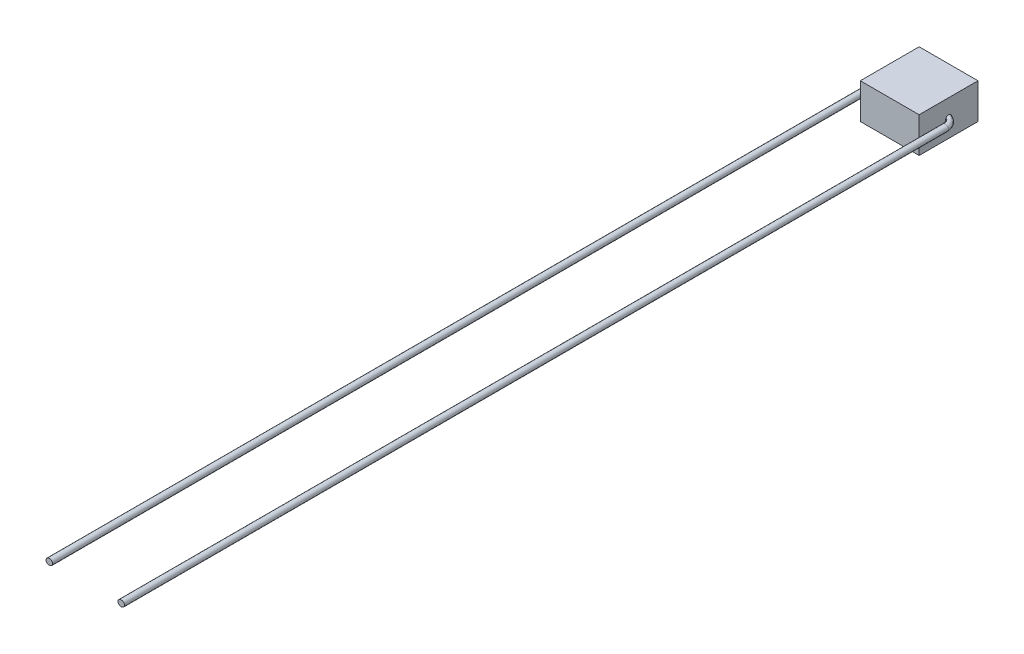
ISO-10303-21;
HEADER;
FILE_DESCRIPTION(('STEP AP214'),'2;1');
FILE_NAME('part.step','',(''),(''),'','','');
FILE_SCHEMA(('AUTOMOTIVE_DESIGN { 1 0 10303 214 1 1 1 1 }'));
ENDSEC;
DATA;
#1=APPLICATION_CONTEXT('core data for automotive mechanical design processes');
#2=APPLICATION_PROTOCOL_DEFINITION('international standard','automotive_design',2000,#1);
#3=PRODUCT_CONTEXT('',#1,'mechanical');
#4=PRODUCT('Part','Part','',(#3));
#5=PRODUCT_RELATED_PRODUCT_CATEGORY('part','',(#4));
#6=PRODUCT_DEFINITION_FORMATION('','',#4);
#7=PRODUCT_DEFINITION_CONTEXT('part definition',#1,'design');
#8=PRODUCT_DEFINITION('design','',#6,#7);
#9=PRODUCT_DEFINITION_SHAPE('','',#8);
#10=(LENGTH_UNIT() NAMED_UNIT(*) SI_UNIT(.MILLI.,.METRE.));
#11=(NAMED_UNIT(*) PLANE_ANGLE_UNIT() SI_UNIT($,.RADIAN.));
#12=(NAMED_UNIT(*) SI_UNIT($,.STERADIAN.) SOLID_ANGLE_UNIT());
#13=UNCERTAINTY_MEASURE_WITH_UNIT(LENGTH_MEASURE(1.E-05),#10,'distance_accuracy_value','');
#14=(GEOMETRIC_REPRESENTATION_CONTEXT(3) GLOBAL_UNCERTAINTY_ASSIGNED_CONTEXT((#13)) GLOBAL_UNIT_ASSIGNED_CONTEXT((#10,
#11,#12)) REPRESENTATION_CONTEXT('',''));
#15=CARTESIAN_POINT('',(0.,0.,0.));
#16=DIRECTION('',(0.,0.,1.));
#17=DIRECTION('',(1.,0.,0.));
#18=AXIS2_PLACEMENT_3D('',#15,#16,#17);
#19=CARTESIAN_POINT('',(-2.5,3.,-2.5));
#20=DIRECTION('',(1.,0.,0.));
#21=DIRECTION('',(0.,0.,-1.));
#22=AXIS2_PLACEMENT_3D('',#19,#20,#21);
#23=PLANE('',#22);
#24=DIRECTION('',(0.,0.,1.));
#25=VECTOR('',#24,1.);
#26=CARTESIAN_POINT('',(-2.5,0.,-2.5));
#27=LINE('',#26,#25);
#28=CARTESIAN_POINT('',(-2.5,0.,-2.5));
#29=VERTEX_POINT('',#28);
#30=CARTESIAN_POINT('',(-2.5,0.,2.5));
#31=VERTEX_POINT('',#30);
#32=EDGE_CURVE('E114',#29,#31,#27,.T.);
#33=ORIENTED_EDGE('',*,*,#32,.T.);
#34=DIRECTION('',(0.,-1.,0.));
#35=VECTOR('',#34,1.);
#36=CARTESIAN_POINT('',(-2.5,3.,2.5));
#37=LINE('',#36,#35);
#38=CARTESIAN_POINT('',(-2.5,3.,2.5));
#39=VERTEX_POINT('',#38);
#40=EDGE_CURVE('E50',#39,#31,#37,.T.);
#41=ORIENTED_EDGE('',*,*,#40,.F.);
#42=DIRECTION('',(0.,0.,1.));
#43=VECTOR('',#42,1.);
#44=CARTESIAN_POINT('',(-2.5,3.,-2.5));
#45=LINE('',#44,#43);
#46=CARTESIAN_POINT('',(-2.5,3.,-2.5));
#47=VERTEX_POINT('',#46);
#48=EDGE_CURVE('E94',#47,#39,#45,.T.);
#49=ORIENTED_EDGE('',*,*,#48,.F.);
#50=DIRECTION('',(0.,-1.,0.));
#51=VECTOR('',#50,1.);
#52=CARTESIAN_POINT('',(-2.5,3.,-2.5));
#53=LINE('',#52,#51);
#54=EDGE_CURVE('E110',#47,#29,#53,.T.);
#55=ORIENTED_EDGE('',*,*,#54,.T.);
#56=EDGE_LOOP('',(#33,#41,#49,#55));
#57=FACE_BOUND('',#56,.T.);
#58=CARTESIAN_POINT('',(-2.5,1.5,0.));
#59=DIRECTION('',(1.,0.,0.));
#60=DIRECTION('',(0.,0.,-1.));
#61=AXIS2_PLACEMENT_3D('',#58,#59,#60);
#62=CIRCLE('',#61,0.25);
#63=CARTESIAN_POINT('',(-2.5,1.5,-0.25));
#64=VERTEX_POINT('',#63);
#65=EDGE_CURVE('E11',#64,#64,#62,.F.);
#66=ORIENTED_EDGE('',*,*,#65,.F.);
#67=EDGE_LOOP('',(#66));
#68=FACE_BOUND('',#67,.T.);
#69=ADVANCED_FACE('F41',(#57,#68),#23,.F.);
#70=CARTESIAN_POINT('',(-2.5,3.,2.5));
#71=DIRECTION('',(0.,0.,-1.));
#72=DIRECTION('',(-1.,0.,0.));
#73=AXIS2_PLACEMENT_3D('',#70,#71,#72);
#74=PLANE('',#73);
#75=DIRECTION('',(1.,0.,0.));
#76=VECTOR('',#75,1.);
#77=CARTESIAN_POINT('',(-2.5,0.,2.5));
#78=LINE('',#77,#76);
#79=CARTESIAN_POINT('',(2.5,0.,2.5));
#80=VERTEX_POINT('',#79);
#81=EDGE_CURVE('E100',#31,#80,#78,.T.);
#82=ORIENTED_EDGE('',*,*,#81,.T.);
#83=DIRECTION('',(0.,-1.,0.));
#84=VECTOR('',#83,1.);
#85=CARTESIAN_POINT('',(2.5,3.,2.5));
#86=LINE('',#85,#84);
#87=CARTESIAN_POINT('',(2.5,3.,2.5));
#88=VERTEX_POINT('',#87);
#89=EDGE_CURVE('E98',#88,#80,#86,.T.);
#90=ORIENTED_EDGE('',*,*,#89,.F.);
#91=DIRECTION('',(1.,0.,0.));
#92=VECTOR('',#91,1.);
#93=CARTESIAN_POINT('',(-2.5,3.,2.5));
#94=LINE('',#93,#92);
#95=EDGE_CURVE('E89',#39,#88,#94,.T.);
#96=ORIENTED_EDGE('',*,*,#95,.F.);
#97=ORIENTED_EDGE('',*,*,#40,.T.);
#98=EDGE_LOOP('',(#82,#90,#96,#97));
#99=FACE_BOUND('',#98,.T.);
#100=ADVANCED_FACE('F99',(#99),#74,.F.);
#101=CARTESIAN_POINT('',(2.5,3.,-2.5));
#102=DIRECTION('',(-1.,0.,0.));
#103=DIRECTION('',(0.,0.,1.));
#104=AXIS2_PLACEMENT_3D('',#101,#102,#103);
#105=PLANE('',#104);
#106=CARTESIAN_POINT('',(2.5,1.5,0.));
#107=DIRECTION('',(1.,0.,0.));
#108=DIRECTION('',(0.,0.,-1.));
#109=AXIS2_PLACEMENT_3D('',#106,#107,#108);
#110=CIRCLE('',#109,0.25);
#111=CARTESIAN_POINT('',(2.5,1.5,-0.25));
#112=VERTEX_POINT('',#111);
#113=EDGE_CURVE('E118',#112,#112,#110,.T.);
#114=ORIENTED_EDGE('',*,*,#113,.F.);
#115=EDGE_LOOP('',(#114));
#116=FACE_BOUND('',#115,.T.);
#117=DIRECTION('',(0.,0.,-1.));
#118=VECTOR('',#117,1.);
#119=CARTESIAN_POINT('',(2.5,0.,-2.5));
#120=LINE('',#119,#118);
#121=CARTESIAN_POINT('',(2.5,0.,-2.5));
#122=VERTEX_POINT('',#121);
#123=EDGE_CURVE('E75',#80,#122,#120,.T.);
#124=ORIENTED_EDGE('',*,*,#123,.T.);
#125=DIRECTION('',(0.,-1.,0.));
#126=VECTOR('',#125,1.);
#127=CARTESIAN_POINT('',(2.5,3.,-2.5));
#128=LINE('',#127,#126);
#129=CARTESIAN_POINT('',(2.5,3.,-2.5));
#130=VERTEX_POINT('',#129);
#131=EDGE_CURVE('E102',#130,#122,#128,.T.);
#132=ORIENTED_EDGE('',*,*,#131,.F.);
#133=DIRECTION('',(0.,0.,-1.));
#134=VECTOR('',#133,1.);
#135=CARTESIAN_POINT('',(2.5,3.,-2.5));
#136=LINE('',#135,#134);
#137=EDGE_CURVE('E92',#88,#130,#136,.T.);
#138=ORIENTED_EDGE('',*,*,#137,.F.);
#139=ORIENTED_EDGE('',*,*,#89,.T.);
#140=EDGE_LOOP('',(#124,#132,#138,#139));
#141=FACE_BOUND('',#140,.T.);
#142=ADVANCED_FACE('F104',(#116,#141),#105,.F.);
#143=CARTESIAN_POINT('',(-2.5,3.,-2.5));
#144=DIRECTION('',(0.,0.,1.));
#145=DIRECTION('',(1.,0.,0.));
#146=AXIS2_PLACEMENT_3D('',#143,#144,#145);
#147=PLANE('',#146);
#148=DIRECTION('',(-1.,0.,0.));
#149=VECTOR('',#148,1.);
#150=CARTESIAN_POINT('',(-2.5,0.,-2.5));
#151=LINE('',#150,#149);
#152=EDGE_CURVE('E81',#122,#29,#151,.T.);
#153=ORIENTED_EDGE('',*,*,#152,.T.);
#154=ORIENTED_EDGE('',*,*,#54,.F.);
#155=DIRECTION('',(-1.,0.,0.));
#156=VECTOR('',#155,1.);
#157=CARTESIAN_POINT('',(-2.5,3.,-2.5));
#158=LINE('',#157,#156);
#159=EDGE_CURVE('E58',#130,#47,#158,.T.);
#160=ORIENTED_EDGE('',*,*,#159,.F.);
#161=ORIENTED_EDGE('',*,*,#131,.T.);
#162=EDGE_LOOP('',(#153,#154,#160,#161));
#163=FACE_BOUND('',#162,.T.);
#164=ADVANCED_FACE('F144',(#163),#147,.F.);
#165=CARTESIAN_POINT('',(0.,3.,0.));
#166=DIRECTION('',(0.,1.,0.));
#167=DIRECTION('',(0.,0.,1.));
#168=AXIS2_PLACEMENT_3D('',#165,#166,#167);
#169=PLANE('',#168);
#170=ORIENTED_EDGE('',*,*,#48,.T.);
#171=ORIENTED_EDGE('',*,*,#95,.T.);
#172=ORIENTED_EDGE('',*,*,#137,.T.);
#173=ORIENTED_EDGE('',*,*,#159,.T.);
#174=EDGE_LOOP('',(#170,#171,#172,#173));
#175=FACE_BOUND('',#174,.T.);
#176=ADVANCED_FACE('F90',(#175),#169,.T.);
#177=CARTESIAN_POINT('',(0.,0.,0.));
#178=DIRECTION('',(0.,1.,0.));
#179=DIRECTION('',(0.,0.,1.));
#180=AXIS2_PLACEMENT_3D('',#177,#178,#179);
#181=PLANE('',#180);
#182=ORIENTED_EDGE('',*,*,#32,.F.);
#183=ORIENTED_EDGE('',*,*,#152,.F.);
#184=ORIENTED_EDGE('',*,*,#123,.F.);
#185=ORIENTED_EDGE('',*,*,#81,.F.);
#186=EDGE_LOOP('',(#182,#183,#184,#185));
#187=FACE_BOUND('',#186,.T.);
#188=ADVANCED_FACE('F133',(#187),#181,.F.);
#189=CARTESIAN_POINT('',(2.5,1.5,-0.25));
#190=CARTESIAN_POINT('',(2.57893203698894,1.5,-0.21520301726241));
#191=CARTESIAN_POINT('',(2.73295056280089,1.5,-0.147304351671167));
#192=CARTESIAN_POINT('',(2.9533834381563,1.5,0.0116007905448319));
#193=CARTESIAN_POINT('',(3.12623759924124,1.5,0.204534711833755));
#194=CARTESIAN_POINT('',(3.24210297711785,1.5,0.41409407708232));
#195=CARTESIAN_POINT('',(3.31154512482762,1.5,0.622424083123833));
#196=CARTESIAN_POINT('',(3.32755392245252,1.5,0.760479713628911));
#197=CARTESIAN_POINT('',(3.33574248040076,1.5,0.831095668490727));
#198=CARTESIAN_POINT('',(2.5,2.,-0.25));
#199=CARTESIAN_POINT('',(2.57893203698894,2.,-0.21520301726241));
#200=CARTESIAN_POINT('',(2.73295056280089,2.,-0.147304351671167));
#201=CARTESIAN_POINT('',(2.9533834381563,2.,0.0116007905448319));
#202=CARTESIAN_POINT('',(3.12623759924124,2.,0.204534711833755));
#203=CARTESIAN_POINT('',(3.24210297711784,2.,0.41409407708232));
#204=CARTESIAN_POINT('',(3.31154512482762,2.,0.622424083123833));
#205=CARTESIAN_POINT('',(3.32755392245252,2.,0.760479713628911));
#206=CARTESIAN_POINT('',(3.33574248040076,2.,0.831095668490727));
#207=CARTESIAN_POINT('',(2.5,2.,0.25));
#208=CARTESIAN_POINT('',(2.54237772794755,2.,0.28313395224096));
#209=CARTESIAN_POINT('',(2.62506855203787,2.,0.347787579249109));
#210=CARTESIAN_POINT('',(2.69405316953538,2.,0.45608139112393));
#211=CARTESIAN_POINT('',(2.72729442356852,2.,0.549825771660714));
#212=CARTESIAN_POINT('',(2.74673699575685,2.,0.639072672846068));
#213=CARTESIAN_POINT('',(2.76182915129759,2.,0.732567961442779));
#214=CARTESIAN_POINT('',(2.7659312365914,2.,0.808651307035796));
#215=CARTESIAN_POINT('',(2.76802946807162,2.,0.847568213781839));
#216=CARTESIAN_POINT('',(2.5,1.5,0.25));
#217=CARTESIAN_POINT('',(2.54237772794755,1.5,0.28313395224096));
#218=CARTESIAN_POINT('',(2.62506855203786,1.5,0.347787579249109));
#219=CARTESIAN_POINT('',(2.69405316953538,1.5,0.45608139112393));
#220=CARTESIAN_POINT('',(2.72729442356852,1.5,0.549825771660714));
#221=CARTESIAN_POINT('',(2.74673699575686,1.5,0.639072672846068));
#222=CARTESIAN_POINT('',(2.76182915129759,1.5,0.732567961442779));
#223=CARTESIAN_POINT('',(2.7659312365914,1.5,0.808651307035796));
#224=CARTESIAN_POINT('',(2.76802946807162,1.5,0.847568213781839));
#225=CARTESIAN_POINT('',(2.5,1.,0.25));
#226=CARTESIAN_POINT('',(2.54237772794755,1.,0.28313395224096));
#227=CARTESIAN_POINT('',(2.62506855203787,1.,0.347787579249109));
#228=CARTESIAN_POINT('',(2.69405316953538,1.,0.45608139112393));
#229=CARTESIAN_POINT('',(2.72729442356852,1.,0.549825771660714));
#230=CARTESIAN_POINT('',(2.74673699575685,1.,0.639072672846068));
#231=CARTESIAN_POINT('',(2.76182915129759,1.,0.732567961442779));
#232=CARTESIAN_POINT('',(2.7659312365914,1.,0.808651307035796));
#233=CARTESIAN_POINT('',(2.76802946807162,1.,0.847568213781839));
#234=CARTESIAN_POINT('',(2.5,1.,-0.25));
#235=CARTESIAN_POINT('',(2.57893203698894,1.,-0.21520301726241));
#236=CARTESIAN_POINT('',(2.73295056280089,1.,-0.147304351671167));
#237=CARTESIAN_POINT('',(2.9533834381563,1.,0.0116007905448319));
#238=CARTESIAN_POINT('',(3.12623759924124,1.,0.204534711833755));
#239=CARTESIAN_POINT('',(3.24210297711784,1.,0.41409407708232));
#240=CARTESIAN_POINT('',(3.31154512482762,1.,0.622424083123833));
#241=CARTESIAN_POINT('',(3.32755392245252,1.,0.760479713628911));
#242=CARTESIAN_POINT('',(3.33574248040076,1.,0.831095668490727));
#243=CARTESIAN_POINT('',(2.5,1.5,-0.25));
#244=CARTESIAN_POINT('',(2.57893203698894,1.5,-0.21520301726241));
#245=CARTESIAN_POINT('',(2.73295056280089,1.5,-0.147304351671167));
#246=CARTESIAN_POINT('',(2.9533834381563,1.5,0.0116007905448319));
#247=CARTESIAN_POINT('',(3.12623759924124,1.5,0.204534711833755));
#248=CARTESIAN_POINT('',(3.24210297711785,1.5,0.41409407708232));
#249=CARTESIAN_POINT('',(3.31154512482762,1.5,0.622424083123833));
#250=CARTESIAN_POINT('',(3.32755392245252,1.5,0.760479713628911));
#251=CARTESIAN_POINT('',(3.33574248040076,1.5,0.831095668490727));
#252=(BOUNDED_SURFACE() B_SPLINE_SURFACE(3,3,((#189,#190,#191,#192,#193,#194,#195,#196,#197),
(#198,#199,#200,#201,#202,#203,#204,#205,#206),(#207,#208,#209,#210,#211,#212,#213,#214,#215),
(#216,#217,#218,#219,#220,#221,#222,#223,#224),(#225,#226,#227,#228,#229,#230,#231,#232,#233),
(#234,#235,#236,#237,#238,#239,#240,#241,#242),(#243,#244,#245,#246,#247,#248,#249,#250,#251)),
.UNSPECIFIED.,.T.,.F.,.F.) B_SPLINE_SURFACE_WITH_KNOTS((4,3,4),(4,1,1,1,1,1,4),(0.,0.5,1.),(0.,
0.193287852681254,0.37715877181145,0.55749102945037,0.700164395043597,0.846633002449055,1.),
.UNSPECIFIED.) GEOMETRIC_REPRESENTATION_ITEM() RATIONAL_B_SPLINE_SURFACE(((1.,1.,1.,1.,1.,1.,1.,
1.,1.),(0.333333333333333,0.333333333333333,0.333333333333333,0.333333333333333,
0.333333333333333,0.333333333333333,0.333333333333333,0.333333333333333,0.333333333333333),
(0.333333333333333,0.333333333333333,0.333333333333333,0.333333333333333,0.333333333333333,
0.333333333333333,0.333333333333333,0.333333333333333,0.333333333333333),(1.,1.,1.,1.,1.,1.,1.,
1.,1.),(0.333333333333333,0.333333333333333,0.333333333333333,0.333333333333333,
0.333333333333333,0.333333333333333,0.333333333333333,0.333333333333333,0.333333333333333),
(0.333333333333333,0.333333333333333,0.333333333333333,0.333333333333333,0.333333333333333,
0.333333333333333,0.333333333333333,0.333333333333333,0.333333333333333),(1.,1.,1.,1.,1.,1.,1.,
1.,1.))) REPRESENTATION_ITEM('') SURFACE());
#253=CARTESIAN_POINT('',(3.33574248040076,1.5,0.831095668490727));
#254=CARTESIAN_POINT('',(3.33574248040076,1.,0.831095668490727));
#255=CARTESIAN_POINT('',(2.76802946807162,1.,0.847568213781839));
#256=CARTESIAN_POINT('',(2.76802946807162,1.5,0.847568213781839));
#257=CARTESIAN_POINT('',(2.76802946807162,2.,0.847568213781839));
#258=CARTESIAN_POINT('',(3.33574248040076,2.,0.831095668490727));
#259=CARTESIAN_POINT('',(3.33574248040076,1.5,0.831095668490727));
#260=(BOUNDED_CURVE() B_SPLINE_CURVE(3,(#253,#254,#255,#256,#257,#258,#259),.UNSPECIFIED.,.T.,
.F.) B_SPLINE_CURVE_WITH_KNOTS((4,3,4),(0.,0.5,1.),
.UNSPECIFIED.) CURVE() GEOMETRIC_REPRESENTATION_ITEM() RATIONAL_B_SPLINE_CURVE((1.,
0.333333333333333,0.333333333333333,1.,0.333333333333333,0.333333333333333,1.)) REPRESENTATION_ITEM(''));
#261=CARTESIAN_POINT('',(3.33574248040076,1.5,0.831095668490727));
#262=VERTEX_POINT('',#261);
#263=EDGE_CURVE('E303',#262,#262,#260,.T.);
#264=ORIENTED_EDGE('',*,*,#113,.T.);
#265=EDGE_LOOP('',(#264));
#266=FACE_BOUND('',#265,.T.);
#267=ORIENTED_EDGE('',*,*,#263,.T.);
#268=EDGE_LOOP('',(#267));
#269=FACE_BOUND('',#268,.T.);
#270=ADVANCED_FACE('F135',(#266,#269),#252,.T.);
#271=CARTESIAN_POINT('',(2.76802946807162,1.5,70.8393319411363));
#272=DIRECTION('',(0.,0.,1.));
#273=DIRECTION('',(1.,0.,0.));
#274=AXIS2_PLACEMENT_3D('',#271,#272,#273);
#275=PLANE('',#274);
#276=CARTESIAN_POINT('',(3.33574248040077,1.5,70.8393319411363));
#277=CARTESIAN_POINT('',(3.33574248040077,1.,70.8393319411363));
#278=CARTESIAN_POINT('',(2.76802946807162,1.,70.8393319411363));
#279=CARTESIAN_POINT('',(2.76802946807162,1.5,70.8393319411363));
#280=CARTESIAN_POINT('',(2.76802946807162,2.,70.8393319411363));
#281=CARTESIAN_POINT('',(3.33574248040077,2.,70.8393319411363));
#282=CARTESIAN_POINT('',(3.33574248040077,1.5,70.8393319411363));
#283=(BOUNDED_CURVE() B_SPLINE_CURVE(3,(#276,#277,#278,#279,#280,#281,#282),.UNSPECIFIED.,.T.,
.F.) B_SPLINE_CURVE_WITH_KNOTS((4,3,4),(0.,0.5,1.),
.UNSPECIFIED.) CURVE() GEOMETRIC_REPRESENTATION_ITEM() RATIONAL_B_SPLINE_CURVE((1.,
0.333333333333333,0.333333333333333,1.,0.333333333333333,0.333333333333333,1.)) REPRESENTATION_ITEM(''));
#284=CARTESIAN_POINT('',(3.33574248040077,1.5,70.8393319411363));
#285=VERTEX_POINT('',#284);
#286=EDGE_CURVE('E321',#285,#285,#283,.F.);
#287=ORIENTED_EDGE('',*,*,#286,.T.);
#288=EDGE_LOOP('',(#287));
#289=FACE_BOUND('',#288,.T.);
#290=ADVANCED_FACE('F141',(#289),#275,.T.);
#291=CARTESIAN_POINT('',(3.33574248040076,1.5,0.831095668490727));
#292=CARTESIAN_POINT('',(3.33574248040077,1.5,70.8393319411363));
#293=CARTESIAN_POINT('',(3.33574248040076,1.,0.831095668490727));
#294=CARTESIAN_POINT('',(3.33574248040077,1.,70.8393319411363));
#295=CARTESIAN_POINT('',(2.76802946807162,1.,0.847568213781839));
#296=CARTESIAN_POINT('',(2.76802946807162,1.,70.8393319411363));
#297=CARTESIAN_POINT('',(2.76802946807162,1.5,0.847568213781839));
#298=CARTESIAN_POINT('',(2.76802946807162,1.5,70.8393319411363));
#299=CARTESIAN_POINT('',(2.76802946807162,2.,0.847568213781839));
#300=CARTESIAN_POINT('',(2.76802946807162,2.,70.8393319411363));
#301=CARTESIAN_POINT('',(3.33574248040076,2.,0.831095668490727));
#302=CARTESIAN_POINT('',(3.33574248040077,2.,70.8393319411363));
#303=CARTESIAN_POINT('',(3.33574248040076,1.5,0.831095668490727));
#304=CARTESIAN_POINT('',(3.33574248040077,1.5,70.8393319411363));
#305=(BOUNDED_SURFACE() B_SPLINE_SURFACE(3,1,((#291,#292),(#293,#294),(#295,#296),(#297,#298),
(#299,#300),(#301,#302),(#303,#304)),.UNSPECIFIED.,.T.,.F.,.F.) B_SPLINE_SURFACE_WITH_KNOTS((4,
3,4),(2,2),(0.,0.5,1.),(0.,1.),
.UNSPECIFIED.) GEOMETRIC_REPRESENTATION_ITEM() RATIONAL_B_SPLINE_SURFACE(((1.,1.),
(0.333333333333333,0.333333333333333),(0.333333333333333,0.333333333333333),(1.,1.),
(0.333333333333333,0.333333333333333),(0.333333333333333,0.333333333333333),(1.,1.))) REPRESENTATION_ITEM('') SURFACE());
#306=ORIENTED_EDGE('',*,*,#263,.F.);
#307=EDGE_LOOP('',(#306));
#308=FACE_BOUND('',#307,.T.);
#309=ORIENTED_EDGE('',*,*,#286,.F.);
#310=EDGE_LOOP('',(#309));
#311=FACE_BOUND('',#310,.T.);
#312=ADVANCED_FACE('F182',(#308,#311),#305,.F.);
#313=CARTESIAN_POINT('',(-2.5,1.5,-0.25));
#314=CARTESIAN_POINT('',(-2.57893203698894,1.5,-0.215203017262409));
#315=CARTESIAN_POINT('',(-2.73295056280089,1.5,-0.147304351671166));
#316=CARTESIAN_POINT('',(-2.9533834381563,1.5,0.0116007905448326));
#317=CARTESIAN_POINT('',(-3.12623759924124,1.5,0.204534711833757));
#318=CARTESIAN_POINT('',(-3.24210297711784,1.5,0.414094077082322));
#319=CARTESIAN_POINT('',(-3.31154512482762,1.5,0.622424083123834));
#320=CARTESIAN_POINT('',(-3.32755392245252,1.5,0.760479713628912));
#321=CARTESIAN_POINT('',(-3.33574248040076,1.5,0.831095668490727));
#322=CARTESIAN_POINT('',(-2.5,2.,-0.25));
#323=CARTESIAN_POINT('',(-2.57893203698894,2.,-0.215203017262409));
#324=CARTESIAN_POINT('',(-2.73295056280089,2.,-0.147304351671166));
#325=CARTESIAN_POINT('',(-2.9533834381563,2.,0.0116007905448325));
#326=CARTESIAN_POINT('',(-3.12623759924124,2.,0.204534711833757));
#327=CARTESIAN_POINT('',(-3.24210297711784,2.,0.414094077082322));
#328=CARTESIAN_POINT('',(-3.31154512482762,2.,0.622424083123833));
#329=CARTESIAN_POINT('',(-3.32755392245252,2.,0.760479713628912));
#330=CARTESIAN_POINT('',(-3.33574248040076,2.,0.831095668490727));
#331=CARTESIAN_POINT('',(-2.5,2.,0.25));
#332=CARTESIAN_POINT('',(-2.54237772794755,2.,0.283133952240961));
#333=CARTESIAN_POINT('',(-2.62506855203786,2.,0.347787579249109));
#334=CARTESIAN_POINT('',(-2.69405316953538,2.,0.456081391123931));
#335=CARTESIAN_POINT('',(-2.72729442356852,2.,0.549825771660714));
#336=CARTESIAN_POINT('',(-2.74673699575686,2.,0.639072672846069));
#337=CARTESIAN_POINT('',(-2.76182915129759,2.,0.732567961442779));
#338=CARTESIAN_POINT('',(-2.7659312365914,2.,0.808651307035796));
#339=CARTESIAN_POINT('',(-2.76802946807162,2.,0.84756821378184));
#340=CARTESIAN_POINT('',(-2.5,1.5,0.25));
#341=CARTESIAN_POINT('',(-2.54237772794755,1.5,0.283133952240961));
#342=CARTESIAN_POINT('',(-2.62506855203786,1.5,0.347787579249109));
#343=CARTESIAN_POINT('',(-2.69405316953538,1.5,0.456081391123931));
#344=CARTESIAN_POINT('',(-2.72729442356852,1.5,0.549825771660714));
#345=CARTESIAN_POINT('',(-2.74673699575685,1.5,0.639072672846069));
#346=CARTESIAN_POINT('',(-2.76182915129759,1.5,0.732567961442779));
#347=CARTESIAN_POINT('',(-2.7659312365914,1.5,0.808651307035796));
#348=CARTESIAN_POINT('',(-2.76802946807162,1.5,0.84756821378184));
#349=CARTESIAN_POINT('',(-2.5,1.,0.25));
#350=CARTESIAN_POINT('',(-2.54237772794755,1.,0.283133952240961));
#351=CARTESIAN_POINT('',(-2.62506855203786,1.,0.347787579249109));
#352=CARTESIAN_POINT('',(-2.69405316953538,1.,0.456081391123931));
#353=CARTESIAN_POINT('',(-2.72729442356852,1.,0.549825771660714));
#354=CARTESIAN_POINT('',(-2.74673699575686,1.,0.639072672846069));
#355=CARTESIAN_POINT('',(-2.76182915129759,1.,0.732567961442779));
#356=CARTESIAN_POINT('',(-2.7659312365914,1.,0.808651307035796));
#357=CARTESIAN_POINT('',(-2.76802946807162,1.,0.84756821378184));
#358=CARTESIAN_POINT('',(-2.5,1.,-0.25));
#359=CARTESIAN_POINT('',(-2.57893203698894,1.,-0.215203017262409));
#360=CARTESIAN_POINT('',(-2.73295056280089,1.,-0.147304351671166));
#361=CARTESIAN_POINT('',(-2.9533834381563,1.,0.0116007905448325));
#362=CARTESIAN_POINT('',(-3.12623759924124,1.,0.204534711833757));
#363=CARTESIAN_POINT('',(-3.24210297711784,1.,0.414094077082322));
#364=CARTESIAN_POINT('',(-3.31154512482762,1.,0.622424083123833));
#365=CARTESIAN_POINT('',(-3.32755392245252,1.,0.760479713628912));
#366=CARTESIAN_POINT('',(-3.33574248040076,1.,0.831095668490727));
#367=CARTESIAN_POINT('',(-2.5,1.5,-0.25));
#368=CARTESIAN_POINT('',(-2.57893203698894,1.5,-0.215203017262409));
#369=CARTESIAN_POINT('',(-2.73295056280089,1.5,-0.147304351671166));
#370=CARTESIAN_POINT('',(-2.9533834381563,1.5,0.0116007905448326));
#371=CARTESIAN_POINT('',(-3.12623759924124,1.5,0.204534711833757));
#372=CARTESIAN_POINT('',(-3.24210297711784,1.5,0.414094077082322));
#373=CARTESIAN_POINT('',(-3.31154512482762,1.5,0.622424083123834));
#374=CARTESIAN_POINT('',(-3.32755392245252,1.5,0.760479713628912));
#375=CARTESIAN_POINT('',(-3.33574248040076,1.5,0.831095668490727));
#376=(BOUNDED_SURFACE() B_SPLINE_SURFACE(3,3,((#313,#314,#315,#316,#317,#318,#319,#320,#321),
(#322,#323,#324,#325,#326,#327,#328,#329,#330),(#331,#332,#333,#334,#335,#336,#337,#338,#339),
(#340,#341,#342,#343,#344,#345,#346,#347,#348),(#349,#350,#351,#352,#353,#354,#355,#356,#357),
(#358,#359,#360,#361,#362,#363,#364,#365,#366),(#367,#368,#369,#370,#371,#372,#373,#374,#375)),
.UNSPECIFIED.,.T.,.F.,.F.) B_SPLINE_SURFACE_WITH_KNOTS((4,3,4),(4,1,1,1,1,1,4),(0.,0.5,1.),(0.,
0.193287852681254,0.37715877181145,0.55749102945037,0.700164395043597,0.846633002449055,1.),
.UNSPECIFIED.) GEOMETRIC_REPRESENTATION_ITEM() RATIONAL_B_SPLINE_SURFACE(((1.,1.,1.,1.,1.,1.,1.,
1.,1.),(0.333333333333333,0.333333333333333,0.333333333333333,0.333333333333333,
0.333333333333333,0.333333333333333,0.333333333333333,0.333333333333333,0.333333333333333),
(0.333333333333333,0.333333333333333,0.333333333333333,0.333333333333333,0.333333333333333,
0.333333333333333,0.333333333333333,0.333333333333333,0.333333333333333),(1.,1.,1.,1.,1.,1.,1.,
1.,1.),(0.333333333333333,0.333333333333333,0.333333333333333,0.333333333333333,
0.333333333333333,0.333333333333333,0.333333333333333,0.333333333333333,0.333333333333333),
(0.333333333333333,0.333333333333333,0.333333333333333,0.333333333333333,0.333333333333333,
0.333333333333333,0.333333333333333,0.333333333333333,0.333333333333333),(1.,1.,1.,1.,1.,1.,1.,
1.,1.))) REPRESENTATION_ITEM('') SURFACE());
#377=CARTESIAN_POINT('',(-3.33574248040076,1.5,0.831095668490727));
#378=CARTESIAN_POINT('',(-3.33574248040076,2.,0.831095668490727));
#379=CARTESIAN_POINT('',(-2.76802946807162,2.,0.84756821378184));
#380=CARTESIAN_POINT('',(-2.76802946807162,1.5,0.84756821378184));
#381=CARTESIAN_POINT('',(-2.76802946807162,1.,0.84756821378184));
#382=CARTESIAN_POINT('',(-3.33574248040076,1.,0.831095668490727));
#383=CARTESIAN_POINT('',(-3.33574248040076,1.5,0.831095668490727));
#384=(BOUNDED_CURVE() B_SPLINE_CURVE(3,(#377,#378,#379,#380,#381,#382,#383),.UNSPECIFIED.,.T.,
.F.) B_SPLINE_CURVE_WITH_KNOTS((4,3,4),(0.,0.5,1.),
.UNSPECIFIED.) CURVE() GEOMETRIC_REPRESENTATION_ITEM() RATIONAL_B_SPLINE_CURVE((1.,
0.333333333333333,0.333333333333333,1.,0.333333333333333,0.333333333333333,1.)) REPRESENTATION_ITEM(''));
#385=CARTESIAN_POINT('',(-3.33574248040076,1.5,0.831095668490727));
#386=VERTEX_POINT('',#385);
#387=EDGE_CURVE('E297',#386,#386,#384,.F.);
#388=ORIENTED_EDGE('',*,*,#65,.T.);
#389=EDGE_LOOP('',(#388));
#390=FACE_BOUND('',#389,.T.);
#391=ORIENTED_EDGE('',*,*,#387,.F.);
#392=EDGE_LOOP('',(#391));
#393=FACE_BOUND('',#392,.T.);
#394=ADVANCED_FACE('F191',(#390,#393),#376,.F.);
#395=CARTESIAN_POINT('',(-2.76802946807161,1.5,70.8393319411363));
#396=DIRECTION('',(0.,0.,-1.));
#397=DIRECTION('',(-1.,0.,0.));
#398=AXIS2_PLACEMENT_3D('',#395,#396,#397);
#399=PLANE('',#398);
#400=CARTESIAN_POINT('',(-3.33574248040076,1.5,70.8393319411363));
#401=CARTESIAN_POINT('',(-3.33574248040076,1.,70.8393319411363));
#402=CARTESIAN_POINT('',(-2.76802946807161,1.,70.8393319411363));
#403=CARTESIAN_POINT('',(-2.76802946807161,1.5,70.8393319411363));
#404=CARTESIAN_POINT('',(-2.76802946807161,2.,70.8393319411363));
#405=CARTESIAN_POINT('',(-3.33574248040076,2.,70.8393319411363));
#406=CARTESIAN_POINT('',(-3.33574248040076,1.5,70.8393319411363));
#407=(BOUNDED_CURVE() B_SPLINE_CURVE(3,(#400,#401,#402,#403,#404,#405,#406),.UNSPECIFIED.,.T.,
.F.) B_SPLINE_CURVE_WITH_KNOTS((4,3,4),(0.,0.5,1.),
.UNSPECIFIED.) CURVE() GEOMETRIC_REPRESENTATION_ITEM() RATIONAL_B_SPLINE_CURVE((1.,
0.333333333333333,0.333333333333333,1.,0.333333333333333,0.333333333333333,1.)) REPRESENTATION_ITEM(''));
#408=CARTESIAN_POINT('',(-3.33574248040076,1.5,70.8393319411363));
#409=VERTEX_POINT('',#408);
#410=EDGE_CURVE('E300',#409,#409,#407,.F.);
#411=ORIENTED_EDGE('',*,*,#410,.F.);
#412=EDGE_LOOP('',(#411));
#413=FACE_BOUND('',#412,.T.);
#414=ADVANCED_FACE('F201',(#413),#399,.F.);
#415=CARTESIAN_POINT('',(-3.33574248040076,1.5,0.831095668490727));
#416=CARTESIAN_POINT('',(-3.33574248040076,1.5,70.8393319411363));
#417=CARTESIAN_POINT('',(-3.33574248040076,1.,0.831095668490727));
#418=CARTESIAN_POINT('',(-3.33574248040076,1.,70.8393319411363));
#419=CARTESIAN_POINT('',(-2.76802946807162,1.,0.84756821378184));
#420=CARTESIAN_POINT('',(-2.76802946807161,1.,70.8393319411363));
#421=CARTESIAN_POINT('',(-2.76802946807162,1.5,0.84756821378184));
#422=CARTESIAN_POINT('',(-2.76802946807161,1.5,70.8393319411363));
#423=CARTESIAN_POINT('',(-2.76802946807162,2.,0.84756821378184));
#424=CARTESIAN_POINT('',(-2.76802946807161,2.,70.8393319411363));
#425=CARTESIAN_POINT('',(-3.33574248040076,2.,0.831095668490727));
#426=CARTESIAN_POINT('',(-3.33574248040076,2.,70.8393319411363));
#427=CARTESIAN_POINT('',(-3.33574248040076,1.5,0.831095668490727));
#428=CARTESIAN_POINT('',(-3.33574248040076,1.5,70.8393319411363));
#429=(BOUNDED_SURFACE() B_SPLINE_SURFACE(3,1,((#415,#416),(#417,#418),(#419,#420),(#421,#422),
(#423,#424),(#425,#426),(#427,#428)),.UNSPECIFIED.,.T.,.F.,.F.) B_SPLINE_SURFACE_WITH_KNOTS((4,
3,4),(2,2),(0.,0.5,1.),(0.,1.),
.UNSPECIFIED.) GEOMETRIC_REPRESENTATION_ITEM() RATIONAL_B_SPLINE_SURFACE(((1.,1.),
(0.333333333333333,0.333333333333333),(0.333333333333333,0.333333333333333),(1.,1.),
(0.333333333333333,0.333333333333333),(0.333333333333333,0.333333333333333),(1.,1.))) REPRESENTATION_ITEM('') SURFACE());
#430=ORIENTED_EDGE('',*,*,#387,.T.);
#431=EDGE_LOOP('',(#430));
#432=FACE_BOUND('',#431,.T.);
#433=ORIENTED_EDGE('',*,*,#410,.T.);
#434=EDGE_LOOP('',(#433));
#435=FACE_BOUND('',#434,.T.);
#436=ADVANCED_FACE('F210',(#432,#435),#429,.T.);
#437=CLOSED_SHELL('',(#69,#100,#142,#164,#176,#188,#270,#290,#312,#394,#414,#436));
#438=MANIFOLD_SOLID_BREP('B2',#437);
#439=ADVANCED_BREP_SHAPE_REPRESENTATION('',(#18,#438),#14);
#440=SHAPE_DEFINITION_REPRESENTATION(#9,#439);
ENDSEC;
END-ISO-10303-21;
